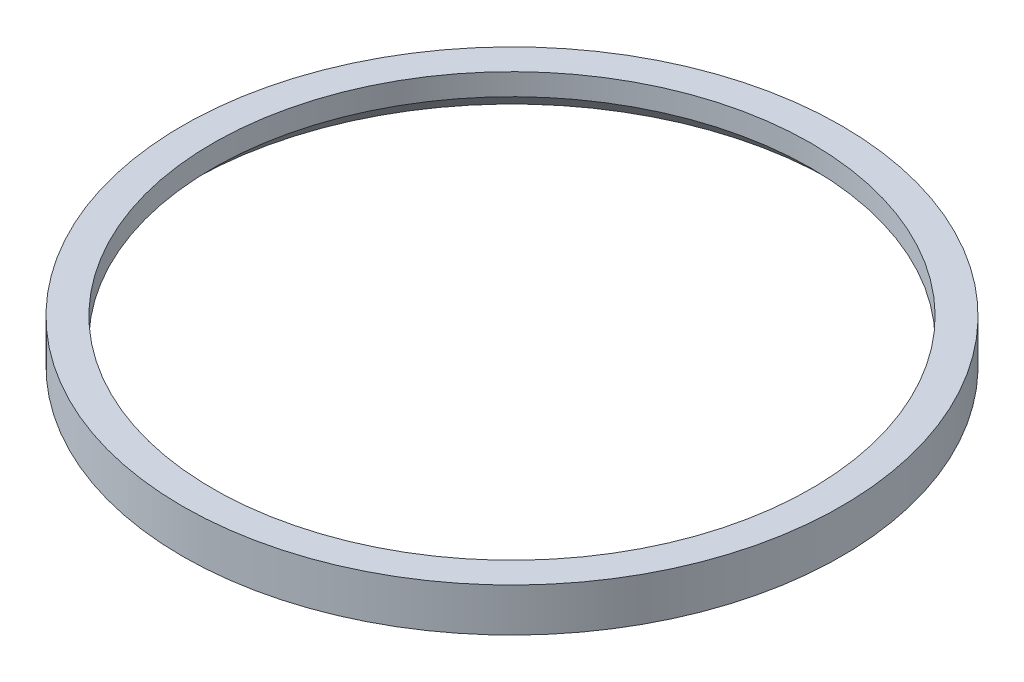
ISO-10303-21;
HEADER;
FILE_DESCRIPTION(('STEP AP214'),'2;1');
FILE_NAME('part.step','',(''),(''),'','','');
FILE_SCHEMA(('AUTOMOTIVE_DESIGN { 1 0 10303 214 1 1 1 1 }'));
ENDSEC;
DATA;
#1=APPLICATION_CONTEXT('core data for automotive mechanical design processes');
#2=APPLICATION_PROTOCOL_DEFINITION('international standard','automotive_design',2000,#1);
#3=PRODUCT_CONTEXT('',#1,'mechanical');
#4=PRODUCT('Part','Part','',(#3));
#5=PRODUCT_RELATED_PRODUCT_CATEGORY('part','',(#4));
#6=PRODUCT_DEFINITION_FORMATION('','',#4);
#7=PRODUCT_DEFINITION_CONTEXT('part definition',#1,'design');
#8=PRODUCT_DEFINITION('design','',#6,#7);
#9=PRODUCT_DEFINITION_SHAPE('','',#8);
#10=(LENGTH_UNIT() NAMED_UNIT(*) SI_UNIT(.MILLI.,.METRE.));
#11=(NAMED_UNIT(*) PLANE_ANGLE_UNIT() SI_UNIT($,.RADIAN.));
#12=(NAMED_UNIT(*) SI_UNIT($,.STERADIAN.) SOLID_ANGLE_UNIT());
#13=UNCERTAINTY_MEASURE_WITH_UNIT(LENGTH_MEASURE(1.E-05),#10,'distance_accuracy_value','');
#14=(GEOMETRIC_REPRESENTATION_CONTEXT(3) GLOBAL_UNCERTAINTY_ASSIGNED_CONTEXT((#13)) GLOBAL_UNIT_ASSIGNED_CONTEXT((#10,
#11,#12)) REPRESENTATION_CONTEXT('',''));
#15=CARTESIAN_POINT('',(0.,0.,0.));
#16=DIRECTION('',(0.,0.,1.));
#17=DIRECTION('',(1.,0.,0.));
#18=AXIS2_PLACEMENT_3D('',#15,#16,#17);
#19=CARTESIAN_POINT('',(0.,1.25,0.));
#20=DIRECTION('',(0.,-1.,0.));
#21=DIRECTION('',(0.,0.,-1.));
#22=AXIS2_PLACEMENT_3D('',#19,#20,#21);
#23=CONICAL_SURFACE('',#22,17.25,0.785398163397446);
#24=CARTESIAN_POINT('',(0.,0.,0.));
#25=DIRECTION('',(0.,-1.,0.));
#26=DIRECTION('',(0.,0.,-1.));
#27=AXIS2_PLACEMENT_3D('',#24,#25,#26);
#28=CIRCLE('',#27,18.5);
#29=CARTESIAN_POINT('',(0.,0.,-18.5));
#30=VERTEX_POINT('',#29);
#31=EDGE_CURVE('E10',#30,#30,#28,.T.);
#32=ORIENTED_EDGE('',*,*,#31,.T.);
#33=EDGE_LOOP('',(#32));
#34=FACE_BOUND('',#33,.T.);
#35=CARTESIAN_POINT('',(0.,1.25,0.));
#36=DIRECTION('',(0.,-1.,0.));
#37=DIRECTION('',(0.,0.,-1.));
#38=AXIS2_PLACEMENT_3D('',#35,#36,#37);
#39=CIRCLE('',#38,17.25);
#40=CARTESIAN_POINT('',(0.,1.25,-17.25));
#41=VERTEX_POINT('',#40);
#42=EDGE_CURVE('E55',#41,#41,#39,.T.);
#43=ORIENTED_EDGE('',*,*,#42,.F.);
#44=EDGE_LOOP('',(#43));
#45=FACE_BOUND('',#44,.T.);
#46=ADVANCED_FACE('F36',(#34,#45),#23,.F.);
#47=CARTESIAN_POINT('',(0.,0.,-18.5));
#48=DIRECTION('',(0.,-1.,0.));
#49=DIRECTION('',(0.,0.,-1.));
#50=AXIS2_PLACEMENT_3D('',#47,#48,#49);
#51=PLANE('',#50);
#52=CARTESIAN_POINT('',(0.,0.,0.));
#53=DIRECTION('',(0.,-1.,0.));
#54=DIRECTION('',(0.,0.,-1.));
#55=AXIS2_PLACEMENT_3D('',#52,#53,#54);
#56=CIRCLE('',#55,19.);
#57=CARTESIAN_POINT('',(0.,0.,-19.));
#58=VERTEX_POINT('',#57);
#59=EDGE_CURVE('E42',#58,#58,#56,.T.);
#60=ORIENTED_EDGE('',*,*,#59,.T.);
#61=EDGE_LOOP('',(#60));
#62=FACE_BOUND('',#61,.T.);
#63=ORIENTED_EDGE('',*,*,#31,.F.);
#64=EDGE_LOOP('',(#63));
#65=FACE_BOUND('',#64,.T.);
#66=ADVANCED_FACE('F63',(#62,#65),#51,.T.);
#67=CARTESIAN_POINT('',(0.,0.,0.));
#68=DIRECTION('',(0.,-1.,0.));
#69=DIRECTION('',(0.,0.,-1.));
#70=AXIS2_PLACEMENT_3D('',#67,#68,#69);
#71=CYLINDRICAL_SURFACE('',#70,19.);
#72=CARTESIAN_POINT('',(0.,2.5,0.));
#73=DIRECTION('',(0.,-1.,0.));
#74=DIRECTION('',(0.,0.,-1.));
#75=AXIS2_PLACEMENT_3D('',#72,#73,#74);
#76=CIRCLE('',#75,19.);
#77=CARTESIAN_POINT('',(0.,2.5,-19.));
#78=VERTEX_POINT('',#77);
#79=EDGE_CURVE('E46',#78,#78,#76,.T.);
#80=ORIENTED_EDGE('',*,*,#79,.T.);
#81=EDGE_LOOP('',(#80));
#82=FACE_BOUND('',#81,.T.);
#83=ORIENTED_EDGE('',*,*,#59,.F.);
#84=EDGE_LOOP('',(#83));
#85=FACE_BOUND('',#84,.T.);
#86=ADVANCED_FACE('F67',(#82,#85),#71,.T.);
#87=CARTESIAN_POINT('',(0.,2.5,-19.));
#88=DIRECTION('',(0.,1.,0.));
#89=DIRECTION('',(0.,0.,1.));
#90=AXIS2_PLACEMENT_3D('',#87,#88,#89);
#91=PLANE('',#90);
#92=CARTESIAN_POINT('',(0.,2.5,0.));
#93=DIRECTION('',(0.,-1.,0.));
#94=DIRECTION('',(0.,0.,-1.));
#95=AXIS2_PLACEMENT_3D('',#92,#93,#94);
#96=CIRCLE('',#95,17.25);
#97=CARTESIAN_POINT('',(0.,2.5,-17.25));
#98=VERTEX_POINT('',#97);
#99=EDGE_CURVE('E50',#98,#98,#96,.T.);
#100=ORIENTED_EDGE('',*,*,#99,.T.);
#101=EDGE_LOOP('',(#100));
#102=FACE_BOUND('',#101,.T.);
#103=ORIENTED_EDGE('',*,*,#79,.F.);
#104=EDGE_LOOP('',(#103));
#105=FACE_BOUND('',#104,.T.);
#106=ADVANCED_FACE('F71',(#102,#105),#91,.T.);
#107=CARTESIAN_POINT('',(0.,0.,0.));
#108=DIRECTION('',(0.,-1.,0.));
#109=DIRECTION('',(0.,0.,-1.));
#110=AXIS2_PLACEMENT_3D('',#107,#108,#109);
#111=CYLINDRICAL_SURFACE('',#110,17.25);
#112=ORIENTED_EDGE('',*,*,#42,.T.);
#113=EDGE_LOOP('',(#112));
#114=FACE_BOUND('',#113,.T.);
#115=ORIENTED_EDGE('',*,*,#99,.F.);
#116=EDGE_LOOP('',(#115));
#117=FACE_BOUND('',#116,.T.);
#118=ADVANCED_FACE('F59',(#114,#117),#111,.F.);
#119=CLOSED_SHELL('',(#46,#66,#86,#106,#118));
#120=MANIFOLD_SOLID_BREP('B2',#119);
#121=ADVANCED_BREP_SHAPE_REPRESENTATION('',(#18,#120),#14);
#122=SHAPE_DEFINITION_REPRESENTATION(#9,#121);
ENDSEC;
END-ISO-10303-21;
